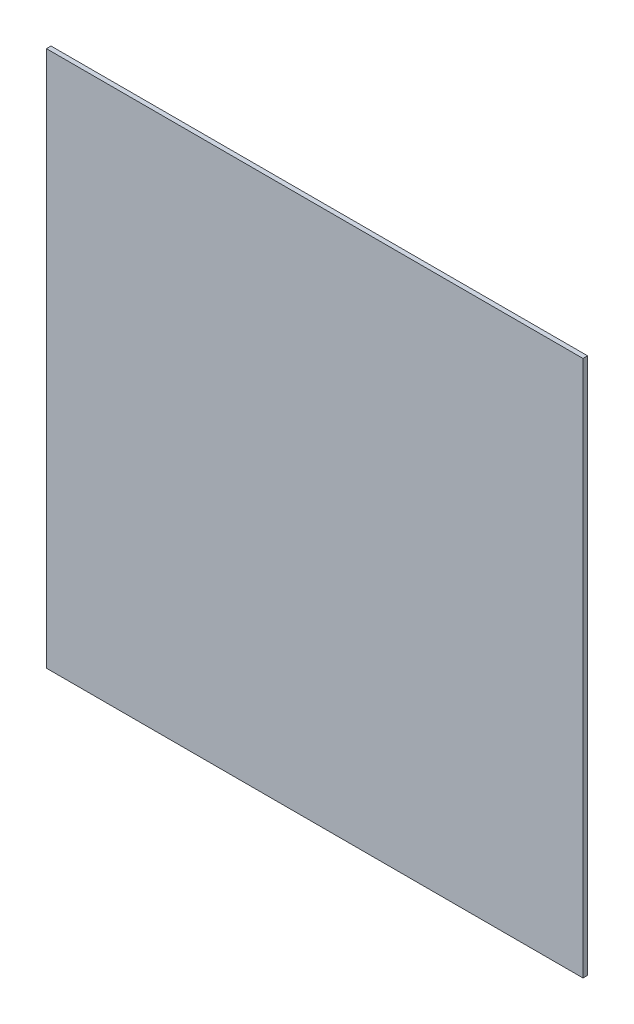
ISO-10303-21;
HEADER;
FILE_DESCRIPTION(('STEP AP214'),'2;1');
FILE_NAME('part.step','',(''),(''),'','','');
FILE_SCHEMA(('AUTOMOTIVE_DESIGN { 1 0 10303 214 1 1 1 1 }'));
ENDSEC;
DATA;
#1=APPLICATION_CONTEXT('core data for automotive mechanical design processes');
#2=APPLICATION_PROTOCOL_DEFINITION('international standard','automotive_design',2000,#1);
#3=PRODUCT_CONTEXT('',#1,'mechanical');
#4=PRODUCT('Part','Part','',(#3));
#5=PRODUCT_RELATED_PRODUCT_CATEGORY('part','',(#4));
#6=PRODUCT_DEFINITION_FORMATION('','',#4);
#7=PRODUCT_DEFINITION_CONTEXT('part definition',#1,'design');
#8=PRODUCT_DEFINITION('design','',#6,#7);
#9=PRODUCT_DEFINITION_SHAPE('','',#8);
#10=(LENGTH_UNIT() NAMED_UNIT(*) SI_UNIT(.MILLI.,.METRE.));
#11=(NAMED_UNIT(*) PLANE_ANGLE_UNIT() SI_UNIT($,.RADIAN.));
#12=(NAMED_UNIT(*) SI_UNIT($,.STERADIAN.) SOLID_ANGLE_UNIT());
#13=UNCERTAINTY_MEASURE_WITH_UNIT(LENGTH_MEASURE(1.E-05),#10,'distance_accuracy_value','');
#14=(GEOMETRIC_REPRESENTATION_CONTEXT(3) GLOBAL_UNCERTAINTY_ASSIGNED_CONTEXT((#13)) GLOBAL_UNIT_ASSIGNED_CONTEXT((#10,
#11,#12)) REPRESENTATION_CONTEXT('',''));
#15=CARTESIAN_POINT('',(0.,0.,0.));
#16=DIRECTION('',(0.,0.,1.));
#17=DIRECTION('',(1.,0.,0.));
#18=AXIS2_PLACEMENT_3D('',#15,#16,#17);
#19=CARTESIAN_POINT('',(585.,585.,5.));
#20=DIRECTION('',(-1.,0.,0.));
#21=DIRECTION('',(0.,0.,1.));
#22=AXIS2_PLACEMENT_3D('',#19,#20,#21);
#23=PLANE('',#22);
#24=DIRECTION('',(0.,1.,0.));
#25=VECTOR('',#24,1.);
#26=CARTESIAN_POINT('',(585.,585.,-5.));
#27=LINE('',#26,#25);
#28=CARTESIAN_POINT('',(585.,-585.,-5.));
#29=VERTEX_POINT('',#28);
#30=CARTESIAN_POINT('',(585.,585.,-5.));
#31=VERTEX_POINT('',#30);
#32=EDGE_CURVE('E112',#29,#31,#27,.T.);
#33=ORIENTED_EDGE('',*,*,#32,.T.);
#34=DIRECTION('',(0.,0.,-1.));
#35=VECTOR('',#34,1.);
#36=CARTESIAN_POINT('',(585.,585.,5.));
#37=LINE('',#36,#35);
#38=CARTESIAN_POINT('',(585.,585.,5.));
#39=VERTEX_POINT('',#38);
#40=EDGE_CURVE('E11',#39,#31,#37,.T.);
#41=ORIENTED_EDGE('',*,*,#40,.F.);
#42=DIRECTION('',(0.,1.,0.));
#43=VECTOR('',#42,1.);
#44=CARTESIAN_POINT('',(585.,585.,5.));
#45=LINE('',#44,#43);
#46=CARTESIAN_POINT('',(585.,-585.,5.));
#47=VERTEX_POINT('',#46);
#48=EDGE_CURVE('E96',#47,#39,#45,.T.);
#49=ORIENTED_EDGE('',*,*,#48,.F.);
#50=DIRECTION('',(0.,0.,-1.));
#51=VECTOR('',#50,1.);
#52=CARTESIAN_POINT('',(585.,-585.,5.));
#53=LINE('',#52,#51);
#54=EDGE_CURVE('E108',#47,#29,#53,.T.);
#55=ORIENTED_EDGE('',*,*,#54,.T.);
#56=EDGE_LOOP('',(#33,#41,#49,#55));
#57=FACE_BOUND('',#56,.T.);
#58=ADVANCED_FACE('F44',(#57),#23,.F.);
#59=CARTESIAN_POINT('',(-585.,585.,5.));
#60=DIRECTION('',(0.,-1.,0.));
#61=DIRECTION('',(0.,0.,-1.));
#62=AXIS2_PLACEMENT_3D('',#59,#60,#61);
#63=PLANE('',#62);
#64=DIRECTION('',(-1.,0.,0.));
#65=VECTOR('',#64,1.);
#66=CARTESIAN_POINT('',(-585.,585.,-5.));
#67=LINE('',#66,#65);
#68=CARTESIAN_POINT('',(-585.,585.,-5.));
#69=VERTEX_POINT('',#68);
#70=EDGE_CURVE('E101',#31,#69,#67,.T.);
#71=ORIENTED_EDGE('',*,*,#70,.T.);
#72=DIRECTION('',(0.,0.,-1.));
#73=VECTOR('',#72,1.);
#74=CARTESIAN_POINT('',(-585.,585.,5.));
#75=LINE('',#74,#73);
#76=CARTESIAN_POINT('',(-585.,585.,5.));
#77=VERTEX_POINT('',#76);
#78=EDGE_CURVE('E53',#77,#69,#75,.T.);
#79=ORIENTED_EDGE('',*,*,#78,.F.);
#80=DIRECTION('',(-1.,0.,0.));
#81=VECTOR('',#80,1.);
#82=CARTESIAN_POINT('',(-585.,585.,5.));
#83=LINE('',#82,#81);
#84=EDGE_CURVE('E91',#39,#77,#83,.T.);
#85=ORIENTED_EDGE('',*,*,#84,.F.);
#86=ORIENTED_EDGE('',*,*,#40,.T.);
#87=EDGE_LOOP('',(#71,#79,#85,#86));
#88=FACE_BOUND('',#87,.T.);
#89=ADVANCED_FACE('F100',(#88),#63,.F.);
#90=CARTESIAN_POINT('',(-585.,585.,5.));
#91=DIRECTION('',(1.,0.,0.));
#92=DIRECTION('',(0.,1.,0.));
#93=AXIS2_PLACEMENT_3D('',#90,#91,#92);
#94=PLANE('',#93);
#95=DIRECTION('',(0.,-1.,0.));
#96=VECTOR('',#95,1.);
#97=CARTESIAN_POINT('',(-585.,585.,-5.));
#98=LINE('',#97,#96);
#99=CARTESIAN_POINT('',(-585.,-585.,-5.));
#100=VERTEX_POINT('',#99);
#101=EDGE_CURVE('E78',#69,#100,#98,.T.);
#102=ORIENTED_EDGE('',*,*,#101,.T.);
#103=DIRECTION('',(0.,0.,-1.));
#104=VECTOR('',#103,1.);
#105=CARTESIAN_POINT('',(-585.,-585.,5.));
#106=LINE('',#105,#104);
#107=CARTESIAN_POINT('',(-585.,-585.,5.));
#108=VERTEX_POINT('',#107);
#109=EDGE_CURVE('E103',#108,#100,#106,.T.);
#110=ORIENTED_EDGE('',*,*,#109,.F.);
#111=DIRECTION('',(0.,-1.,0.));
#112=VECTOR('',#111,1.);
#113=CARTESIAN_POINT('',(-585.,585.,5.));
#114=LINE('',#113,#112);
#115=EDGE_CURVE('E94',#77,#108,#114,.T.);
#116=ORIENTED_EDGE('',*,*,#115,.F.);
#117=ORIENTED_EDGE('',*,*,#78,.T.);
#118=EDGE_LOOP('',(#102,#110,#116,#117));
#119=FACE_BOUND('',#118,.T.);
#120=ADVANCED_FACE('F104',(#119),#94,.F.);
#121=CARTESIAN_POINT('',(-585.,-585.,5.));
#122=DIRECTION('',(0.,1.,0.));
#123=DIRECTION('',(0.,0.,1.));
#124=AXIS2_PLACEMENT_3D('',#121,#122,#123);
#125=PLANE('',#124);
#126=DIRECTION('',(1.,0.,0.));
#127=VECTOR('',#126,1.);
#128=CARTESIAN_POINT('',(-585.,-585.,-5.));
#129=LINE('',#128,#127);
#130=EDGE_CURVE('E84',#100,#29,#129,.T.);
#131=ORIENTED_EDGE('',*,*,#130,.T.);
#132=ORIENTED_EDGE('',*,*,#54,.F.);
#133=DIRECTION('',(1.,0.,0.));
#134=VECTOR('',#133,1.);
#135=CARTESIAN_POINT('',(-585.,-585.,5.));
#136=LINE('',#135,#134);
#137=EDGE_CURVE('E61',#108,#47,#136,.T.);
#138=ORIENTED_EDGE('',*,*,#137,.F.);
#139=ORIENTED_EDGE('',*,*,#109,.T.);
#140=EDGE_LOOP('',(#131,#132,#138,#139));
#141=FACE_BOUND('',#140,.T.);
#142=ADVANCED_FACE('F125',(#141),#125,.F.);
#143=CARTESIAN_POINT('',(0.,0.,5.));
#144=DIRECTION('',(0.,0.,1.));
#145=DIRECTION('',(1.,0.,0.));
#146=AXIS2_PLACEMENT_3D('',#143,#144,#145);
#147=PLANE('',#146);
#148=ORIENTED_EDGE('',*,*,#48,.T.);
#149=ORIENTED_EDGE('',*,*,#84,.T.);
#150=ORIENTED_EDGE('',*,*,#115,.T.);
#151=ORIENTED_EDGE('',*,*,#137,.T.);
#152=EDGE_LOOP('',(#148,#149,#150,#151));
#153=FACE_BOUND('',#152,.T.);
#154=ADVANCED_FACE('F92',(#153),#147,.T.);
#155=CARTESIAN_POINT('',(0.,0.,-5.));
#156=DIRECTION('',(0.,0.,1.));
#157=DIRECTION('',(1.,0.,0.));
#158=AXIS2_PLACEMENT_3D('',#155,#156,#157);
#159=PLANE('',#158);
#160=ORIENTED_EDGE('',*,*,#32,.F.);
#161=ORIENTED_EDGE('',*,*,#130,.F.);
#162=ORIENTED_EDGE('',*,*,#101,.F.);
#163=ORIENTED_EDGE('',*,*,#70,.F.);
#164=EDGE_LOOP('',(#160,#161,#162,#163));
#165=FACE_BOUND('',#164,.T.);
#166=ADVANCED_FACE('F128',(#165),#159,.F.);
#167=CLOSED_SHELL('',(#58,#89,#120,#142,#154,#166));
#168=MANIFOLD_SOLID_BREP('B2',#167);
#169=ADVANCED_BREP_SHAPE_REPRESENTATION('',(#18,#168),#14);
#170=SHAPE_DEFINITION_REPRESENTATION(#9,#169);
ENDSEC;
END-ISO-10303-21;
